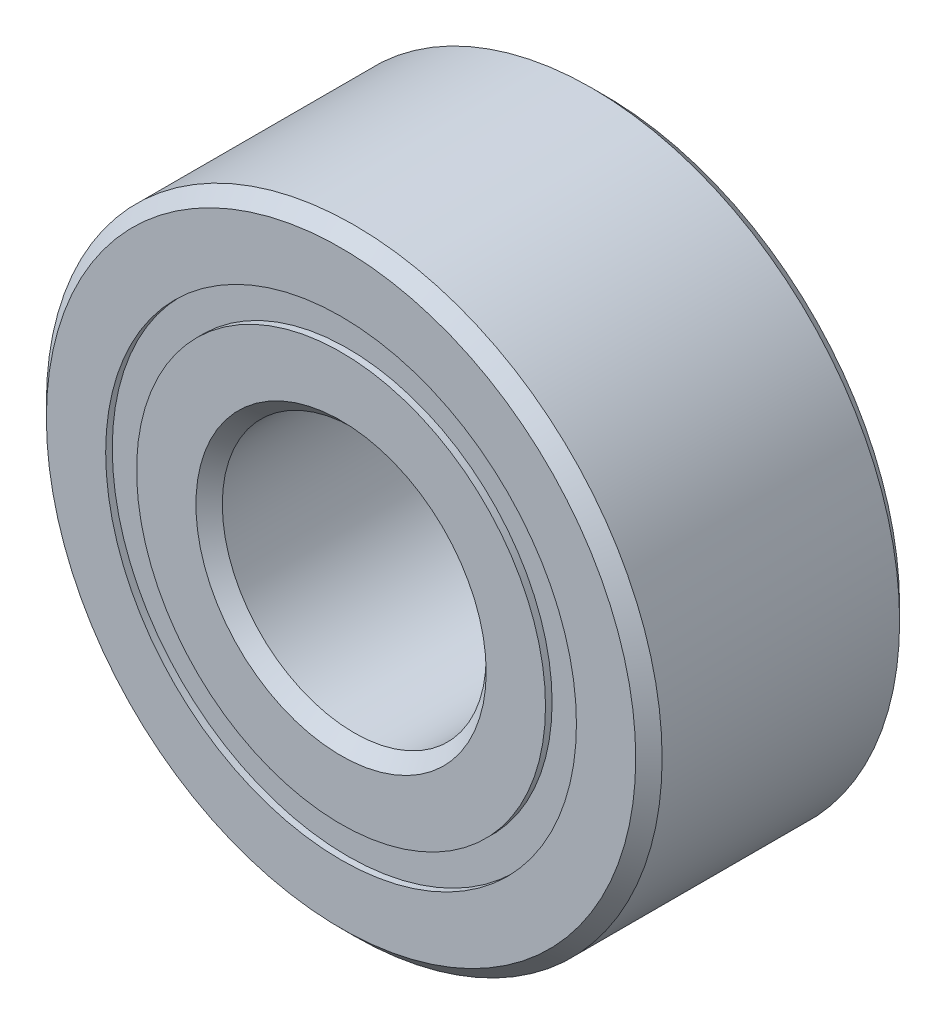
ISO-10303-21;
HEADER;
FILE_DESCRIPTION(('STEP AP214'),'2;1');
FILE_NAME('part.step','',(''),(''),'','','');
FILE_SCHEMA(('AUTOMOTIVE_DESIGN { 1 0 10303 214 1 1 1 1 }'));
ENDSEC;
DATA;
#1=APPLICATION_CONTEXT('core data for automotive mechanical design processes');
#2=APPLICATION_PROTOCOL_DEFINITION('international standard','automotive_design',2000,#1);
#3=PRODUCT_CONTEXT('',#1,'mechanical');
#4=PRODUCT('Part','Part','',(#3));
#5=PRODUCT_RELATED_PRODUCT_CATEGORY('part','',(#4));
#6=PRODUCT_DEFINITION_FORMATION('','',#4);
#7=PRODUCT_DEFINITION_CONTEXT('part definition',#1,'design');
#8=PRODUCT_DEFINITION('design','',#6,#7);
#9=PRODUCT_DEFINITION_SHAPE('','',#8);
#10=(LENGTH_UNIT() NAMED_UNIT(*) SI_UNIT(.MILLI.,.METRE.));
#11=(NAMED_UNIT(*) PLANE_ANGLE_UNIT() SI_UNIT($,.RADIAN.));
#12=(NAMED_UNIT(*) SI_UNIT($,.STERADIAN.) SOLID_ANGLE_UNIT());
#13=UNCERTAINTY_MEASURE_WITH_UNIT(LENGTH_MEASURE(1.E-05),#10,'distance_accuracy_value','');
#14=(GEOMETRIC_REPRESENTATION_CONTEXT(3) GLOBAL_UNCERTAINTY_ASSIGNED_CONTEXT((#13)) GLOBAL_UNIT_ASSIGNED_CONTEXT((#10,
#11,#12)) REPRESENTATION_CONTEXT('',''));
#15=CARTESIAN_POINT('',(0.,0.,0.));
#16=DIRECTION('',(0.,0.,1.));
#17=DIRECTION('',(1.,0.,0.));
#18=AXIS2_PLACEMENT_3D('',#15,#16,#17);
#19=CARTESIAN_POINT('',(0.,2.67582417582418,-1.425));
#20=DIRECTION('',(0.,0.,1.));
#21=DIRECTION('',(1.,0.,0.));
#22=AXIS2_PLACEMENT_3D('',#19,#20,#21);
#23=PLANE('',#22);
#24=CARTESIAN_POINT('',(0.,0.,-1.425));
#25=DIRECTION('',(0.,0.,1.));
#26=DIRECTION('',(1.,0.,0.));
#27=AXIS2_PLACEMENT_3D('',#24,#25,#26);
#28=CIRCLE('',#27,2.67582417582418);
#29=CARTESIAN_POINT('',(2.67582417582418,0.,-1.425));
#30=VERTEX_POINT('',#29);
#31=EDGE_CURVE('E55',#30,#30,#28,.T.);
#32=ORIENTED_EDGE('',*,*,#31,.F.);
#33=EDGE_LOOP('',(#32));
#34=FACE_BOUND('',#33,.T.);
#35=CARTESIAN_POINT('',(0.,0.,-1.425));
#36=DIRECTION('',(0.,0.,1.));
#37=DIRECTION('',(1.,0.,0.));
#38=AXIS2_PLACEMENT_3D('',#35,#36,#37);
#39=CIRCLE('',#38,2.32417582417582);
#40=CARTESIAN_POINT('',(2.32417582417582,0.,-1.425));
#41=VERTEX_POINT('',#40);
#42=EDGE_CURVE('E11',#41,#41,#39,.T.);
#43=ORIENTED_EDGE('',*,*,#42,.T.);
#44=EDGE_LOOP('',(#43));
#45=FACE_BOUND('',#44,.T.);
#46=ADVANCED_FACE('F41',(#34,#45),#23,.F.);
#47=CARTESIAN_POINT('',(0.,0.,1.5));
#48=DIRECTION('',(0.,0.,1.));
#49=DIRECTION('',(1.,0.,0.));
#50=AXIS2_PLACEMENT_3D('',#47,#48,#49);
#51=CYLINDRICAL_SURFACE('',#50,2.32417582417582);
#52=ORIENTED_EDGE('',*,*,#42,.F.);
#53=EDGE_LOOP('',(#52));
#54=FACE_BOUND('',#53,.T.);
#55=CARTESIAN_POINT('',(0.,0.,-0.689462533607661));
#56=DIRECTION('',(0.,0.,1.));
#57=DIRECTION('',(1.,0.,0.));
#58=AXIS2_PLACEMENT_3D('',#55,#56,#57);
#59=CIRCLE('',#58,2.32417582417582);
#60=CARTESIAN_POINT('',(2.32417582417582,0.,-0.689462533607661));
#61=VERTEX_POINT('',#60);
#62=EDGE_CURVE('E47',#61,#61,#59,.T.);
#63=ORIENTED_EDGE('',*,*,#62,.T.);
#64=EDGE_LOOP('',(#63));
#65=FACE_BOUND('',#64,.T.);
#66=ADVANCED_FACE('F64',(#54,#65),#51,.F.);
#67=CARTESIAN_POINT('',(0.,2.67582417582418,-0.689462533607661));
#68=DIRECTION('',(0.,0.,-1.));
#69=DIRECTION('',(-1.,0.,0.));
#70=AXIS2_PLACEMENT_3D('',#67,#68,#69);
#71=PLANE('',#70);
#72=ORIENTED_EDGE('',*,*,#62,.F.);
#73=EDGE_LOOP('',(#72));
#74=FACE_BOUND('',#73,.T.);
#75=CARTESIAN_POINT('',(0.,0.,-0.689462533607661));
#76=DIRECTION('',(0.,0.,1.));
#77=DIRECTION('',(1.,0.,0.));
#78=AXIS2_PLACEMENT_3D('',#75,#76,#77);
#79=CIRCLE('',#78,2.67582417582418);
#80=CARTESIAN_POINT('',(2.67582417582418,0.,-0.689462533607661));
#81=VERTEX_POINT('',#80);
#82=EDGE_CURVE('E51',#81,#81,#79,.T.);
#83=ORIENTED_EDGE('',*,*,#82,.T.);
#84=EDGE_LOOP('',(#83));
#85=FACE_BOUND('',#84,.T.);
#86=ADVANCED_FACE('F68',(#74,#85),#71,.F.);
#87=CARTESIAN_POINT('',(0.,0.,1.5));
#88=DIRECTION('',(0.,0.,1.));
#89=DIRECTION('',(1.,0.,0.));
#90=AXIS2_PLACEMENT_3D('',#87,#88,#89);
#91=CYLINDRICAL_SURFACE('',#90,2.67582417582418);
#92=ORIENTED_EDGE('',*,*,#82,.F.);
#93=EDGE_LOOP('',(#92));
#94=FACE_BOUND('',#93,.T.);
#95=ORIENTED_EDGE('',*,*,#31,.T.);
#96=EDGE_LOOP('',(#95));
#97=FACE_BOUND('',#96,.T.);
#98=ADVANCED_FACE('F61',(#94,#97),#91,.T.);
#99=CLOSED_SHELL('',(#46,#66,#86,#98));
#100=MANIFOLD_SOLID_BREP('B2',#99);
#101=CARTESIAN_POINT('',(0.,2.67582417582418,1.425));
#102=DIRECTION('',(0.,0.,-1.));
#103=DIRECTION('',(-1.,0.,0.));
#104=AXIS2_PLACEMENT_3D('',#101,#102,#103);
#105=PLANE('',#104);
#106=CARTESIAN_POINT('',(0.,0.,1.425));
#107=DIRECTION('',(0.,0.,1.));
#108=DIRECTION('',(1.,0.,0.));
#109=AXIS2_PLACEMENT_3D('',#106,#107,#108);
#110=CIRCLE('',#109,2.32417582417582);
#111=CARTESIAN_POINT('',(2.32417582417582,0.,1.425));
#112=VERTEX_POINT('',#111);
#113=EDGE_CURVE('E40',#112,#112,#110,.T.);
#114=ORIENTED_EDGE('',*,*,#113,.F.);
#115=EDGE_LOOP('',(#114));
#116=FACE_BOUND('',#115,.T.);
#117=CARTESIAN_POINT('',(0.,0.,1.425));
#118=DIRECTION('',(0.,0.,1.));
#119=DIRECTION('',(1.,0.,0.));
#120=AXIS2_PLACEMENT_3D('',#117,#118,#119);
#121=CIRCLE('',#120,2.67582417582418);
#122=CARTESIAN_POINT('',(2.67582417582418,0.,1.425));
#123=VERTEX_POINT('',#122);
#124=EDGE_CURVE('E122',#123,#123,#121,.T.);
#125=ORIENTED_EDGE('',*,*,#124,.T.);
#126=EDGE_LOOP('',(#125));
#127=FACE_BOUND('',#126,.T.);
#128=ADVANCED_FACE('F108',(#116,#127),#105,.F.);
#129=CARTESIAN_POINT('',(0.,0.,1.5));
#130=DIRECTION('',(0.,0.,1.));
#131=DIRECTION('',(1.,0.,0.));
#132=AXIS2_PLACEMENT_3D('',#129,#130,#131);
#133=CYLINDRICAL_SURFACE('',#132,2.32417582417582);
#134=CARTESIAN_POINT('',(0.,0.,0.689462533607661));
#135=DIRECTION('',(0.,0.,1.));
#136=DIRECTION('',(1.,0.,0.));
#137=AXIS2_PLACEMENT_3D('',#134,#135,#136);
#138=CIRCLE('',#137,2.32417582417582);
#139=CARTESIAN_POINT('',(2.32417582417582,0.,0.689462533607661));
#140=VERTEX_POINT('',#139);
#141=EDGE_CURVE('E114',#140,#140,#138,.T.);
#142=ORIENTED_EDGE('',*,*,#141,.F.);
#143=EDGE_LOOP('',(#142));
#144=FACE_BOUND('',#143,.T.);
#145=ORIENTED_EDGE('',*,*,#113,.T.);
#146=EDGE_LOOP('',(#145));
#147=FACE_BOUND('',#146,.T.);
#148=ADVANCED_FACE('F137',(#144,#147),#133,.F.);
#149=CARTESIAN_POINT('',(0.,2.67582417582418,0.689462533607661));
#150=DIRECTION('',(0.,0.,1.));
#151=DIRECTION('',(1.,0.,0.));
#152=AXIS2_PLACEMENT_3D('',#149,#150,#151);
#153=PLANE('',#152);
#154=CARTESIAN_POINT('',(0.,0.,0.689462533607661));
#155=DIRECTION('',(0.,0.,1.));
#156=DIRECTION('',(1.,0.,0.));
#157=AXIS2_PLACEMENT_3D('',#154,#155,#156);
#158=CIRCLE('',#157,2.67582417582418);
#159=CARTESIAN_POINT('',(2.67582417582418,0.,0.689462533607661));
#160=VERTEX_POINT('',#159);
#161=EDGE_CURVE('E118',#160,#160,#158,.T.);
#162=ORIENTED_EDGE('',*,*,#161,.F.);
#163=EDGE_LOOP('',(#162));
#164=FACE_BOUND('',#163,.T.);
#165=ORIENTED_EDGE('',*,*,#141,.T.);
#166=EDGE_LOOP('',(#165));
#167=FACE_BOUND('',#166,.T.);
#168=ADVANCED_FACE('F132',(#164,#167),#153,.F.);
#169=CARTESIAN_POINT('',(0.,0.,1.5));
#170=DIRECTION('',(0.,0.,1.));
#171=DIRECTION('',(1.,0.,0.));
#172=AXIS2_PLACEMENT_3D('',#169,#170,#171);
#173=CYLINDRICAL_SURFACE('',#172,2.67582417582418);
#174=ORIENTED_EDGE('',*,*,#124,.F.);
#175=EDGE_LOOP('',(#174));
#176=FACE_BOUND('',#175,.T.);
#177=ORIENTED_EDGE('',*,*,#161,.T.);
#178=EDGE_LOOP('',(#177));
#179=FACE_BOUND('',#178,.T.);
#180=ADVANCED_FACE('F129',(#176,#179),#173,.T.);
#181=CLOSED_SHELL('',(#128,#148,#168,#180));
#182=MANIFOLD_SOLID_BREP('B6',#181);
#183=CARTESIAN_POINT('',(-1.24999999999997,2.16506350946111,0.));
#184=DIRECTION('',(0.,0.,1.));
#185=DIRECTION('',(-0.499999999999989,0.866025403784445,0.));
#186=AXIS2_PLACEMENT_3D('',#183,#184,#185);
#187=SPHERICAL_SURFACE('',#186,0.689462533607661);
#188=CARTESIAN_POINT('',(-1.24999999999997,2.16506350946111,0.689462533607661));
#189=VERTEX_POINT('',#188);
#190=VERTEX_LOOP('',#189);
#191=FACE_BOUND('',#190,.T.);
#192=ADVANCED_FACE('F175',(#191),#187,.T.);
#193=CLOSED_SHELL('',(#192));
#194=MANIFOLD_SOLID_BREP('B35',#193);
#195=CARTESIAN_POINT('',(-2.16506350946108,1.25000000000003,0.));
#196=DIRECTION('',(0.,0.,1.));
#197=DIRECTION('',(-0.866025403784433,0.50000000000001,0.));
#198=AXIS2_PLACEMENT_3D('',#195,#196,#197);
#199=SPHERICAL_SURFACE('',#198,0.689462533607661);
#200=CARTESIAN_POINT('',(-2.16506350946108,1.25000000000003,0.689462533607661));
#201=VERTEX_POINT('',#200);
#202=VERTEX_LOOP('',#201);
#203=FACE_BOUND('',#202,.T.);
#204=ADVANCED_FACE('F195',(#203),#199,.T.);
#205=CLOSED_SHELL('',(#204));
#206=MANIFOLD_SOLID_BREP('B104',#205);
#207=CARTESIAN_POINT('',(-2.5,0.,0.));
#208=DIRECTION('',(0.,0.,1.));
#209=DIRECTION('',(-1.,0.,0.));
#210=AXIS2_PLACEMENT_3D('',#207,#208,#209);
#211=SPHERICAL_SURFACE('',#210,0.689462533607661);
#212=CARTESIAN_POINT('',(-2.5,0.,0.689462533607661));
#213=VERTEX_POINT('',#212);
#214=VERTEX_LOOP('',#213);
#215=FACE_BOUND('',#214,.T.);
#216=ADVANCED_FACE('F215',(#215),#211,.T.);
#217=CLOSED_SHELL('',(#216));
#218=MANIFOLD_SOLID_BREP('B171',#217);
#219=CARTESIAN_POINT('',(-2.16506350946111,-1.24999999999998,0.));
#220=DIRECTION('',(0.,0.,1.));
#221=DIRECTION('',(-0.866025403784443,-0.499999999999992,0.));
#222=AXIS2_PLACEMENT_3D('',#219,#220,#221);
#223=SPHERICAL_SURFACE('',#222,0.689462533607661);
#224=CARTESIAN_POINT('',(-2.16506350946111,-1.24999999999998,0.689462533607661));
#225=VERTEX_POINT('',#224);
#226=VERTEX_LOOP('',#225);
#227=FACE_BOUND('',#226,.T.);
#228=ADVANCED_FACE('F235',(#227),#223,.T.);
#229=CLOSED_SHELL('',(#228));
#230=MANIFOLD_SOLID_BREP('B191',#229);
#231=CARTESIAN_POINT('',(-1.25000000000002,-2.16506350946109,0.));
#232=DIRECTION('',(0.,0.,1.));
#233=DIRECTION('',(-0.500000000000007,-0.866025403784435,0.));
#234=AXIS2_PLACEMENT_3D('',#231,#232,#233);
#235=SPHERICAL_SURFACE('',#234,0.689462533607661);
#236=CARTESIAN_POINT('',(-1.25000000000002,-2.16506350946109,0.689462533607661));
#237=VERTEX_POINT('',#236);
#238=VERTEX_LOOP('',#237);
#239=FACE_BOUND('',#238,.T.);
#240=ADVANCED_FACE('F255',(#239),#235,.T.);
#241=CLOSED_SHELL('',(#240));
#242=MANIFOLD_SOLID_BREP('B211',#241);
#243=CARTESIAN_POINT('',(0.,-2.5,0.));
#244=DIRECTION('',(0.,0.,1.));
#245=DIRECTION('',(0.,-1.,0.));
#246=AXIS2_PLACEMENT_3D('',#243,#244,#245);
#247=SPHERICAL_SURFACE('',#246,0.689462533607661);
#248=CARTESIAN_POINT('',(0.,-2.5,0.689462533607661));
#249=VERTEX_POINT('',#248);
#250=VERTEX_LOOP('',#249);
#251=FACE_BOUND('',#250,.T.);
#252=ADVANCED_FACE('F275',(#251),#247,.T.);
#253=CLOSED_SHELL('',(#252));
#254=MANIFOLD_SOLID_BREP('B231',#253);
#255=CARTESIAN_POINT('',(1.24999999999999,-2.1650635094611,0.));
#256=DIRECTION('',(0.,0.,1.));
#257=DIRECTION('',(0.499999999999995,-0.866025403784442,0.));
#258=AXIS2_PLACEMENT_3D('',#255,#256,#257);
#259=SPHERICAL_SURFACE('',#258,0.689462533607661);
#260=CARTESIAN_POINT('',(1.24999999999999,-2.1650635094611,0.689462533607661));
#261=VERTEX_POINT('',#260);
#262=VERTEX_LOOP('',#261);
#263=FACE_BOUND('',#262,.T.);
#264=ADVANCED_FACE('F295',(#263),#259,.T.);
#265=CLOSED_SHELL('',(#264));
#266=MANIFOLD_SOLID_BREP('B251',#265);
#267=CARTESIAN_POINT('',(2.16506350946109,-1.25000000000001,0.));
#268=DIRECTION('',(0.,0.,1.));
#269=DIRECTION('',(0.866025403784436,-0.500000000000004,0.));
#270=AXIS2_PLACEMENT_3D('',#267,#268,#269);
#271=SPHERICAL_SURFACE('',#270,0.689462533607661);
#272=CARTESIAN_POINT('',(2.16506350946109,-1.25000000000001,0.689462533607661));
#273=VERTEX_POINT('',#272);
#274=VERTEX_LOOP('',#273);
#275=FACE_BOUND('',#274,.T.);
#276=ADVANCED_FACE('F315',(#275),#271,.T.);
#277=CLOSED_SHELL('',(#276));
#278=MANIFOLD_SOLID_BREP('B271',#277);
#279=CARTESIAN_POINT('',(2.5,0.,0.));
#280=DIRECTION('',(0.,0.,1.));
#281=DIRECTION('',(1.,0.,0.));
#282=AXIS2_PLACEMENT_3D('',#279,#280,#281);
#283=SPHERICAL_SURFACE('',#282,0.689462533607661);
#284=CARTESIAN_POINT('',(2.5,0.,0.689462533607661));
#285=VERTEX_POINT('',#284);
#286=VERTEX_LOOP('',#285);
#287=FACE_BOUND('',#286,.T.);
#288=ADVANCED_FACE('F335',(#287),#283,.T.);
#289=CLOSED_SHELL('',(#288));
#290=MANIFOLD_SOLID_BREP('B291',#289);
#291=CARTESIAN_POINT('',(2.1650635094611,1.25,0.));
#292=DIRECTION('',(0.,0.,1.));
#293=DIRECTION('',(0.86602540378444,0.499999999999998,0.));
#294=AXIS2_PLACEMENT_3D('',#291,#292,#293);
#295=SPHERICAL_SURFACE('',#294,0.689462533607661);
#296=CARTESIAN_POINT('',(2.1650635094611,1.25,0.689462533607661));
#297=VERTEX_POINT('',#296);
#298=VERTEX_LOOP('',#297);
#299=FACE_BOUND('',#298,.T.);
#300=ADVANCED_FACE('F355',(#299),#295,.T.);
#301=CLOSED_SHELL('',(#300));
#302=MANIFOLD_SOLID_BREP('B311',#301);
#303=CARTESIAN_POINT('',(1.25,2.1650635094611,0.));
#304=DIRECTION('',(0.,0.,1.));
#305=DIRECTION('',(0.500000000000001,0.866025403784438,0.));
#306=AXIS2_PLACEMENT_3D('',#303,#304,#305);
#307=SPHERICAL_SURFACE('',#306,0.689462533607661);
#308=CARTESIAN_POINT('',(1.25,2.1650635094611,0.689462533607661));
#309=VERTEX_POINT('',#308);
#310=VERTEX_LOOP('',#309);
#311=FACE_BOUND('',#310,.T.);
#312=ADVANCED_FACE('F375',(#311),#307,.T.);
#313=CLOSED_SHELL('',(#312));
#314=MANIFOLD_SOLID_BREP('B331',#313);
#315=CARTESIAN_POINT('',(0.,2.5,0.));
#316=DIRECTION('',(0.,0.,1.));
#317=DIRECTION('',(0.,1.,0.));
#318=AXIS2_PLACEMENT_3D('',#315,#316,#317);
#319=SPHERICAL_SURFACE('',#318,0.689462533607661);
#320=CARTESIAN_POINT('',(0.,2.5,0.689462533607661));
#321=VERTEX_POINT('',#320);
#322=VERTEX_LOOP('',#321);
#323=FACE_BOUND('',#322,.T.);
#324=ADVANCED_FACE('F397',(#323),#319,.T.);
#325=CLOSED_SHELL('',(#324));
#326=MANIFOLD_SOLID_BREP('B351',#325);
#327=CARTESIAN_POINT('',(0.,2.32417582417582,1.5));
#328=DIRECTION('',(0.,0.,-1.));
#329=DIRECTION('',(-1.,0.,0.));
#330=AXIS2_PLACEMENT_3D('',#327,#328,#329);
#331=PLANE('',#330);
#332=CARTESIAN_POINT('',(0.,0.,1.5));
#333=DIRECTION('',(0.,0.,1.));
#334=DIRECTION('',(1.,0.,0.));
#335=AXIS2_PLACEMENT_3D('',#332,#333,#334);
#336=CIRCLE('',#335,1.65);
#337=CARTESIAN_POINT('',(1.65,0.,1.5));
#338=VERTEX_POINT('',#337);
#339=EDGE_CURVE('E444',#338,#338,#336,.T.);
#340=ORIENTED_EDGE('',*,*,#339,.F.);
#341=EDGE_LOOP('',(#340));
#342=FACE_BOUND('',#341,.T.);
#343=CARTESIAN_POINT('',(0.,0.,1.5));
#344=DIRECTION('',(0.,0.,1.));
#345=DIRECTION('',(1.,0.,0.));
#346=AXIS2_PLACEMENT_3D('',#343,#344,#345);
#347=CIRCLE('',#346,2.32417582417582);
#348=CARTESIAN_POINT('',(2.32417582417582,0.,1.5));
#349=VERTEX_POINT('',#348);
#350=EDGE_CURVE('E396',#349,#349,#347,.T.);
#351=ORIENTED_EDGE('',*,*,#350,.T.);
#352=EDGE_LOOP('',(#351));
#353=FACE_BOUND('',#352,.T.);
#354=ADVANCED_FACE('F416',(#342,#353),#331,.F.);
#355=CARTESIAN_POINT('',(0.,0.,1.5));
#356=DIRECTION('',(0.,0.,1.));
#357=DIRECTION('',(1.,0.,0.));
#358=AXIS2_PLACEMENT_3D('',#355,#356,#357);
#359=CYLINDRICAL_SURFACE('',#358,2.32417582417582);
#360=ORIENTED_EDGE('',*,*,#350,.F.);
#361=EDGE_LOOP('',(#360));
#362=FACE_BOUND('',#361,.T.);
#363=CARTESIAN_POINT('',(0.,0.,0.666666666666667));
#364=DIRECTION('',(0.,0.,1.));
#365=DIRECTION('',(1.,0.,0.));
#366=AXIS2_PLACEMENT_3D('',#363,#364,#365);
#367=CIRCLE('',#366,2.32417582417582);
#368=CARTESIAN_POINT('',(2.32417582417582,0.,0.666666666666667));
#369=VERTEX_POINT('',#368);
#370=EDGE_CURVE('E422',#369,#369,#367,.T.);
#371=ORIENTED_EDGE('',*,*,#370,.T.);
#372=EDGE_LOOP('',(#371));
#373=FACE_BOUND('',#372,.T.);
#374=ADVANCED_FACE('F451',(#362,#373),#359,.T.);
#375=CARTESIAN_POINT('',(0.,0.,0.));
#376=DIRECTION('',(0.,0.,1.));
#377=DIRECTION('',(1.,0.,0.));
#378=AXIS2_PLACEMENT_3D('',#375,#376,#377);
#379=TOROIDAL_SURFACE('',#378,2.5,0.68946253360766);
#380=ORIENTED_EDGE('',*,*,#370,.F.);
#381=EDGE_LOOP('',(#380));
#382=FACE_BOUND('',#381,.T.);
#383=CARTESIAN_POINT('',(0.,0.,-0.666666666666667));
#384=DIRECTION('',(0.,0.,1.));
#385=DIRECTION('',(1.,0.,0.));
#386=AXIS2_PLACEMENT_3D('',#383,#384,#385);
#387=CIRCLE('',#386,2.32417582417582);
#388=CARTESIAN_POINT('',(2.32417582417582,0.,-0.666666666666667));
#389=VERTEX_POINT('',#388);
#390=EDGE_CURVE('E426',#389,#389,#387,.T.);
#391=ORIENTED_EDGE('',*,*,#390,.T.);
#392=EDGE_LOOP('',(#391));
#393=FACE_BOUND('',#392,.T.);
#394=ADVANCED_FACE('F455',(#382,#393),#379,.F.);
#395=CARTESIAN_POINT('',(0.,0.,1.5));
#396=DIRECTION('',(0.,0.,1.));
#397=DIRECTION('',(1.,0.,0.));
#398=AXIS2_PLACEMENT_3D('',#395,#396,#397);
#399=CYLINDRICAL_SURFACE('',#398,2.32417582417582);
#400=ORIENTED_EDGE('',*,*,#390,.F.);
#401=EDGE_LOOP('',(#400));
#402=FACE_BOUND('',#401,.T.);
#403=CARTESIAN_POINT('',(0.,0.,-1.5));
#404=DIRECTION('',(0.,0.,1.));
#405=DIRECTION('',(1.,0.,0.));
#406=AXIS2_PLACEMENT_3D('',#403,#404,#405);
#407=CIRCLE('',#406,2.32417582417582);
#408=CARTESIAN_POINT('',(2.32417582417582,0.,-1.5));
#409=VERTEX_POINT('',#408);
#410=EDGE_CURVE('E430',#409,#409,#407,.T.);
#411=ORIENTED_EDGE('',*,*,#410,.T.);
#412=EDGE_LOOP('',(#411));
#413=FACE_BOUND('',#412,.T.);
#414=ADVANCED_FACE('F460',(#402,#413),#399,.T.);
#415=CARTESIAN_POINT('',(0.,1.65,-1.5));
#416=DIRECTION('',(0.,0.,1.));
#417=DIRECTION('',(1.,0.,0.));
#418=AXIS2_PLACEMENT_3D('',#415,#416,#417);
#419=PLANE('',#418);
#420=ORIENTED_EDGE('',*,*,#410,.F.);
#421=EDGE_LOOP('',(#420));
#422=FACE_BOUND('',#421,.T.);
#423=CARTESIAN_POINT('',(0.,0.,-1.5));
#424=DIRECTION('',(0.,0.,1.));
#425=DIRECTION('',(1.,0.,0.));
#426=AXIS2_PLACEMENT_3D('',#423,#424,#425);
#427=CIRCLE('',#426,1.65);
#428=CARTESIAN_POINT('',(1.65,0.,-1.5));
#429=VERTEX_POINT('',#428);
#430=EDGE_CURVE('E435',#429,#429,#427,.T.);
#431=ORIENTED_EDGE('',*,*,#430,.T.);
#432=EDGE_LOOP('',(#431));
#433=FACE_BOUND('',#432,.T.);
#434=ADVANCED_FACE('F466',(#422,#433),#419,.F.);
#435=CARTESIAN_POINT('',(0.,0.,-1.35));
#436=DIRECTION('',(0.,0.,-1.));
#437=DIRECTION('',(-1.,0.,0.));
#438=AXIS2_PLACEMENT_3D('',#435,#436,#437);
#439=CONICAL_SURFACE('',#438,1.5,0.785398163397448);
#440=ORIENTED_EDGE('',*,*,#430,.F.);
#441=EDGE_LOOP('',(#440));
#442=FACE_BOUND('',#441,.T.);
#443=CARTESIAN_POINT('',(0.,0.,-1.35));
#444=DIRECTION('',(0.,0.,1.));
#445=DIRECTION('',(1.,0.,0.));
#446=AXIS2_PLACEMENT_3D('',#443,#444,#445);
#447=CIRCLE('',#446,1.5);
#448=CARTESIAN_POINT('',(1.5,0.,-1.35));
#449=VERTEX_POINT('',#448);
#450=EDGE_CURVE('E438',#449,#449,#447,.T.);
#451=ORIENTED_EDGE('',*,*,#450,.T.);
#452=EDGE_LOOP('',(#451));
#453=FACE_BOUND('',#452,.T.);
#454=ADVANCED_FACE('F470',(#442,#453),#439,.F.);
#455=CARTESIAN_POINT('',(0.,0.,1.5));
#456=DIRECTION('',(0.,0.,1.));
#457=DIRECTION('',(1.,0.,0.));
#458=AXIS2_PLACEMENT_3D('',#455,#456,#457);
#459=CYLINDRICAL_SURFACE('',#458,1.5);
#460=ORIENTED_EDGE('',*,*,#450,.F.);
#461=EDGE_LOOP('',(#460));
#462=FACE_BOUND('',#461,.T.);
#463=CARTESIAN_POINT('',(0.,0.,1.35));
#464=DIRECTION('',(0.,0.,1.));
#465=DIRECTION('',(1.,0.,0.));
#466=AXIS2_PLACEMENT_3D('',#463,#464,#465);
#467=CIRCLE('',#466,1.5);
#468=CARTESIAN_POINT('',(1.5,0.,1.35));
#469=VERTEX_POINT('',#468);
#470=EDGE_CURVE('E441',#469,#469,#467,.T.);
#471=ORIENTED_EDGE('',*,*,#470,.T.);
#472=EDGE_LOOP('',(#471));
#473=FACE_BOUND('',#472,.T.);
#474=ADVANCED_FACE('F474',(#462,#473),#459,.F.);
#475=CARTESIAN_POINT('',(0.,0.,1.5));
#476=DIRECTION('',(0.,0.,1.));
#477=DIRECTION('',(1.,0.,0.));
#478=AXIS2_PLACEMENT_3D('',#475,#476,#477);
#479=CONICAL_SURFACE('',#478,1.65,0.785398163397448);
#480=ORIENTED_EDGE('',*,*,#470,.F.);
#481=EDGE_LOOP('',(#480));
#482=FACE_BOUND('',#481,.T.);
#483=ORIENTED_EDGE('',*,*,#339,.T.);
#484=EDGE_LOOP('',(#483));
#485=FACE_BOUND('',#484,.T.);
#486=ADVANCED_FACE('F448',(#482,#485),#479,.F.);
#487=CLOSED_SHELL('',(#354,#374,#394,#414,#434,#454,#474,#486));
#488=MANIFOLD_SOLID_BREP('B371',#487);
#489=CARTESIAN_POINT('',(0.,0.,1.35));
#490=DIRECTION('',(0.,0.,-1.));
#491=DIRECTION('',(-1.,0.,0.));
#492=AXIS2_PLACEMENT_3D('',#489,#490,#491);
#493=CONICAL_SURFACE('',#492,3.5,0.785398163397448);
#494=CARTESIAN_POINT('',(0.,0.,1.5));
#495=DIRECTION('',(0.,0.,1.));
#496=DIRECTION('',(1.,0.,0.));
#497=AXIS2_PLACEMENT_3D('',#494,#495,#496);
#498=CIRCLE('',#497,3.35);
#499=CARTESIAN_POINT('',(3.35,0.,1.5));
#500=VERTEX_POINT('',#499);
#501=EDGE_CURVE('E565',#500,#500,#498,.T.);
#502=ORIENTED_EDGE('',*,*,#501,.F.);
#503=EDGE_LOOP('',(#502));
#504=FACE_BOUND('',#503,.T.);
#505=CARTESIAN_POINT('',(0.,0.,1.35));
#506=DIRECTION('',(0.,0.,1.));
#507=DIRECTION('',(1.,0.,0.));
#508=AXIS2_PLACEMENT_3D('',#505,#506,#507);
#509=CIRCLE('',#508,3.5);
#510=CARTESIAN_POINT('',(3.5,0.,1.35));
#511=VERTEX_POINT('',#510);
#512=EDGE_CURVE('E415',#511,#511,#509,.T.);
#513=ORIENTED_EDGE('',*,*,#512,.T.);
#514=EDGE_LOOP('',(#513));
#515=FACE_BOUND('',#514,.T.);
#516=ADVANCED_FACE('F537',(#504,#515),#493,.T.);
#517=CARTESIAN_POINT('',(0.,0.,1.5));
#518=DIRECTION('',(0.,0.,1.));
#519=DIRECTION('',(1.,0.,0.));
#520=AXIS2_PLACEMENT_3D('',#517,#518,#519);
#521=CYLINDRICAL_SURFACE('',#520,3.5);
#522=ORIENTED_EDGE('',*,*,#512,.F.);
#523=EDGE_LOOP('',(#522));
#524=FACE_BOUND('',#523,.T.);
#525=CARTESIAN_POINT('',(0.,0.,-1.35));
#526=DIRECTION('',(0.,0.,1.));
#527=DIRECTION('',(1.,0.,0.));
#528=AXIS2_PLACEMENT_3D('',#525,#526,#527);
#529=CIRCLE('',#528,3.5);
#530=CARTESIAN_POINT('',(3.5,0.,-1.35));
#531=VERTEX_POINT('',#530);
#532=EDGE_CURVE('E543',#531,#531,#529,.T.);
#533=ORIENTED_EDGE('',*,*,#532,.T.);
#534=EDGE_LOOP('',(#533));
#535=FACE_BOUND('',#534,.T.);
#536=ADVANCED_FACE('F572',(#524,#535),#521,.T.);
#537=CARTESIAN_POINT('',(0.,0.,-1.5));
#538=DIRECTION('',(0.,0.,1.));
#539=DIRECTION('',(1.,0.,0.));
#540=AXIS2_PLACEMENT_3D('',#537,#538,#539);
#541=CONICAL_SURFACE('',#540,3.35,0.785398163397448);
#542=ORIENTED_EDGE('',*,*,#532,.F.);
#543=EDGE_LOOP('',(#542));
#544=FACE_BOUND('',#543,.T.);
#545=CARTESIAN_POINT('',(0.,0.,-1.5));
#546=DIRECTION('',(0.,0.,1.));
#547=DIRECTION('',(1.,0.,0.));
#548=AXIS2_PLACEMENT_3D('',#545,#546,#547);
#549=CIRCLE('',#548,3.35);
#550=CARTESIAN_POINT('',(3.35,0.,-1.5));
#551=VERTEX_POINT('',#550);
#552=EDGE_CURVE('E547',#551,#551,#549,.T.);
#553=ORIENTED_EDGE('',*,*,#552,.T.);
#554=EDGE_LOOP('',(#553));
#555=FACE_BOUND('',#554,.T.);
#556=ADVANCED_FACE('F576',(#544,#555),#541,.T.);
#557=CARTESIAN_POINT('',(0.,3.35,-1.5));
#558=DIRECTION('',(0.,0.,1.));
#559=DIRECTION('',(1.,0.,0.));
#560=AXIS2_PLACEMENT_3D('',#557,#558,#559);
#561=PLANE('',#560);
#562=ORIENTED_EDGE('',*,*,#552,.F.);
#563=EDGE_LOOP('',(#562));
#564=FACE_BOUND('',#563,.T.);
#565=CARTESIAN_POINT('',(0.,0.,-1.5));
#566=DIRECTION('',(0.,0.,1.));
#567=DIRECTION('',(1.,0.,0.));
#568=AXIS2_PLACEMENT_3D('',#565,#566,#567);
#569=CIRCLE('',#568,2.67582417582418);
#570=CARTESIAN_POINT('',(2.67582417582418,0.,-1.5));
#571=VERTEX_POINT('',#570);
#572=EDGE_CURVE('E551',#571,#571,#569,.T.);
#573=ORIENTED_EDGE('',*,*,#572,.T.);
#574=EDGE_LOOP('',(#573));
#575=FACE_BOUND('',#574,.T.);
#576=ADVANCED_FACE('F581',(#564,#575),#561,.F.);
#577=CARTESIAN_POINT('',(0.,0.,1.5));
#578=DIRECTION('',(0.,0.,1.));
#579=DIRECTION('',(1.,0.,0.));
#580=AXIS2_PLACEMENT_3D('',#577,#578,#579);
#581=CYLINDRICAL_SURFACE('',#580,2.67582417582418);
#582=ORIENTED_EDGE('',*,*,#572,.F.);
#583=EDGE_LOOP('',(#582));
#584=FACE_BOUND('',#583,.T.);
#585=CARTESIAN_POINT('',(0.,0.,-0.666666666666667));
#586=DIRECTION('',(0.,0.,1.));
#587=DIRECTION('',(1.,0.,0.));
#588=AXIS2_PLACEMENT_3D('',#585,#586,#587);
#589=CIRCLE('',#588,2.67582417582418);
#590=CARTESIAN_POINT('',(2.67582417582418,0.,-0.666666666666667));
#591=VERTEX_POINT('',#590);
#592=EDGE_CURVE('E556',#591,#591,#589,.T.);
#593=ORIENTED_EDGE('',*,*,#592,.T.);
#594=EDGE_LOOP('',(#593));
#595=FACE_BOUND('',#594,.T.);
#596=ADVANCED_FACE('F587',(#584,#595),#581,.F.);
#597=CARTESIAN_POINT('',(0.,0.,0.));
#598=DIRECTION('',(0.,0.,1.));
#599=DIRECTION('',(1.,0.,0.));
#600=AXIS2_PLACEMENT_3D('',#597,#598,#599);
#601=TOROIDAL_SURFACE('',#600,2.5,0.689462533607661);
#602=ORIENTED_EDGE('',*,*,#592,.F.);
#603=EDGE_LOOP('',(#602));
#604=FACE_BOUND('',#603,.T.);
#605=CARTESIAN_POINT('',(0.,0.,0.666666666666667));
#606=DIRECTION('',(0.,0.,1.));
#607=DIRECTION('',(1.,0.,0.));
#608=AXIS2_PLACEMENT_3D('',#605,#606,#607);
#609=CIRCLE('',#608,2.67582417582418);
#610=CARTESIAN_POINT('',(2.67582417582418,0.,0.666666666666667));
#611=VERTEX_POINT('',#610);
#612=EDGE_CURVE('E559',#611,#611,#609,.T.);
#613=ORIENTED_EDGE('',*,*,#612,.T.);
#614=EDGE_LOOP('',(#613));
#615=FACE_BOUND('',#614,.T.);
#616=ADVANCED_FACE('F591',(#604,#615),#601,.F.);
#617=CARTESIAN_POINT('',(0.,0.,1.5));
#618=DIRECTION('',(0.,0.,1.));
#619=DIRECTION('',(1.,0.,0.));
#620=AXIS2_PLACEMENT_3D('',#617,#618,#619);
#621=CYLINDRICAL_SURFACE('',#620,2.67582417582418);
#622=ORIENTED_EDGE('',*,*,#612,.F.);
#623=EDGE_LOOP('',(#622));
#624=FACE_BOUND('',#623,.T.);
#625=CARTESIAN_POINT('',(0.,0.,1.5));
#626=DIRECTION('',(0.,0.,1.));
#627=DIRECTION('',(1.,0.,0.));
#628=AXIS2_PLACEMENT_3D('',#625,#626,#627);
#629=CIRCLE('',#628,2.67582417582418);
#630=CARTESIAN_POINT('',(2.67582417582418,0.,1.5));
#631=VERTEX_POINT('',#630);
#632=EDGE_CURVE('E562',#631,#631,#629,.T.);
#633=ORIENTED_EDGE('',*,*,#632,.T.);
#634=EDGE_LOOP('',(#633));
#635=FACE_BOUND('',#634,.T.);
#636=ADVANCED_FACE('F595',(#624,#635),#621,.F.);
#637=CARTESIAN_POINT('',(0.,3.35,1.5));
#638=DIRECTION('',(0.,0.,-1.));
#639=DIRECTION('',(-1.,0.,0.));
#640=AXIS2_PLACEMENT_3D('',#637,#638,#639);
#641=PLANE('',#640);
#642=ORIENTED_EDGE('',*,*,#632,.F.);
#643=EDGE_LOOP('',(#642));
#644=FACE_BOUND('',#643,.T.);
#645=ORIENTED_EDGE('',*,*,#501,.T.);
#646=EDGE_LOOP('',(#645));
#647=FACE_BOUND('',#646,.T.);
#648=ADVANCED_FACE('F569',(#644,#647),#641,.F.);
#649=CLOSED_SHELL('',(#516,#536,#556,#576,#596,#616,#636,#648));
#650=MANIFOLD_SOLID_BREP('B391',#649);
#651=ADVANCED_BREP_SHAPE_REPRESENTATION('',(#18,#100,#182,#194,#206,#218,#230,#242,#254,#266,
#278,#290,#302,#314,#326,#488,#650),#14);
#652=SHAPE_DEFINITION_REPRESENTATION(#9,#651);
ENDSEC;
END-ISO-10303-21;
